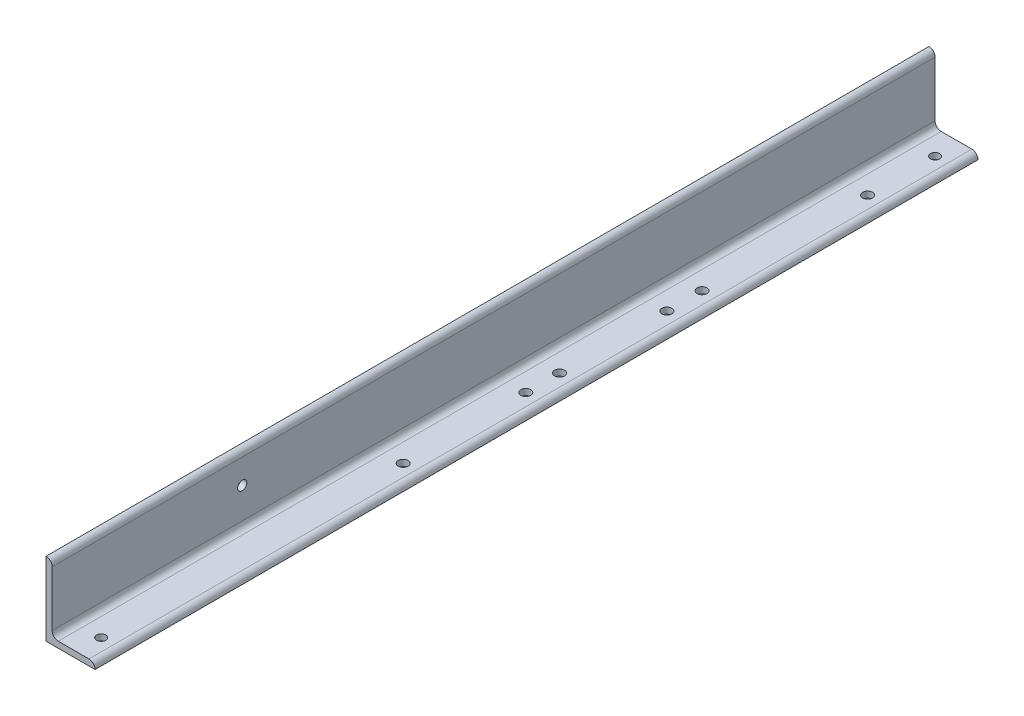
ISO-10303-21;
HEADER;
FILE_DESCRIPTION(('STEP AP214'),'2;1');
FILE_NAME('part.step','',(''),(''),'','','');
FILE_SCHEMA(('AUTOMOTIVE_DESIGN { 1 0 10303 214 1 1 1 1 }'));
ENDSEC;
DATA;
#1=APPLICATION_CONTEXT('core data for automotive mechanical design processes');
#2=APPLICATION_PROTOCOL_DEFINITION('international standard','automotive_design',2000,#1);
#3=PRODUCT_CONTEXT('',#1,'mechanical');
#4=PRODUCT('Part','Part','',(#3));
#5=PRODUCT_RELATED_PRODUCT_CATEGORY('part','',(#4));
#6=PRODUCT_DEFINITION_FORMATION('','',#4);
#7=PRODUCT_DEFINITION_CONTEXT('part definition',#1,'design');
#8=PRODUCT_DEFINITION('design','',#6,#7);
#9=PRODUCT_DEFINITION_SHAPE('','',#8);
#10=(LENGTH_UNIT() NAMED_UNIT(*) SI_UNIT(.MILLI.,.METRE.));
#11=(NAMED_UNIT(*) PLANE_ANGLE_UNIT() SI_UNIT($,.RADIAN.));
#12=(NAMED_UNIT(*) SI_UNIT($,.STERADIAN.) SOLID_ANGLE_UNIT());
#13=UNCERTAINTY_MEASURE_WITH_UNIT(LENGTH_MEASURE(1.E-05),#10,'distance_accuracy_value','');
#14=(GEOMETRIC_REPRESENTATION_CONTEXT(3) GLOBAL_UNCERTAINTY_ASSIGNED_CONTEXT((#13)) GLOBAL_UNIT_ASSIGNED_CONTEXT((#10,
#11,#12)) REPRESENTATION_CONTEXT('',''));
#15=CARTESIAN_POINT('',(0.,0.,0.));
#16=DIRECTION('',(0.,0.,1.));
#17=DIRECTION('',(1.,0.,0.));
#18=AXIS2_PLACEMENT_3D('',#15,#16,#17);
#19=CARTESIAN_POINT('',(12.7,139.70508,914.4));
#20=DIRECTION('',(-1.,0.,0.));
#21=DIRECTION('',(0.,-1.,0.));
#22=AXIS2_PLACEMENT_3D('',#19,#20,#21);
#23=PLANE('',#22);
#24=DIRECTION('',(0.,1.,0.));
#25=VECTOR('',#24,1.);
#26=CARTESIAN_POINT('',(12.7,139.70508,-914.4));
#27=LINE('',#26,#25);
#28=CARTESIAN_POINT('',(12.7,25.4,-914.4));
#29=VERTEX_POINT('',#28);
#30=CARTESIAN_POINT('',(12.7,139.70508,-914.4));
#31=VERTEX_POINT('',#30);
#32=EDGE_CURVE('E132',#29,#31,#27,.T.);
#33=ORIENTED_EDGE('',*,*,#32,.T.);
#34=DIRECTION('',(0.,0.,-1.));
#35=VECTOR('',#34,1.);
#36=CARTESIAN_POINT('',(12.7,139.70508,914.4));
#37=LINE('',#36,#35);
#38=CARTESIAN_POINT('',(12.7,139.70508,914.4));
#39=VERTEX_POINT('',#38);
#40=EDGE_CURVE('E111',#39,#31,#37,.T.);
#41=ORIENTED_EDGE('',*,*,#40,.F.);
#42=DIRECTION('',(0.,1.,0.));
#43=VECTOR('',#42,1.);
#44=CARTESIAN_POINT('',(12.7,139.70508,914.4));
#45=LINE('',#44,#43);
#46=CARTESIAN_POINT('',(12.7,25.4,914.4));
#47=VERTEX_POINT('',#46);
#48=EDGE_CURVE('E102',#47,#39,#45,.T.);
#49=ORIENTED_EDGE('',*,*,#48,.F.);
#50=DIRECTION('',(0.,0.,-1.));
#51=VECTOR('',#50,1.);
#52=CARTESIAN_POINT('',(12.7,25.4,914.4));
#53=LINE('',#52,#51);
#54=EDGE_CURVE('E141',#47,#29,#53,.T.);
#55=ORIENTED_EDGE('',*,*,#54,.T.);
#56=EDGE_LOOP('',(#33,#41,#49,#55));
#57=FACE_BOUND('',#56,.T.);
#58=CARTESIAN_POINT('',(12.7,88.9,520.7));
#59=DIRECTION('',(1.,0.,0.));
#60=DIRECTION('',(0.,0.,-1.));
#61=AXIS2_PLACEMENT_3D('',#58,#59,#60);
#62=CIRCLE('',#61,9.525);
#63=CARTESIAN_POINT('',(12.7,88.9,511.175));
#64=VERTEX_POINT('',#63);
#65=EDGE_CURVE('E228',#64,#64,#62,.T.);
#66=ORIENTED_EDGE('',*,*,#65,.F.);
#67=EDGE_LOOP('',(#66));
#68=FACE_BOUND('',#67,.T.);
#69=ADVANCED_FACE('F17',(#57,#68),#23,.F.);
#70=CARTESIAN_POINT('',(101.6,0.,914.4));
#71=DIRECTION('',(0.,1.,0.));
#72=DIRECTION('',(-1.,0.,0.));
#73=AXIS2_PLACEMENT_3D('',#70,#71,#72);
#74=PLANE('',#73);
#75=CARTESIAN_POINT('',(63.5,0.,-85.725));
#76=DIRECTION('',(0.,1.,0.));
#77=DIRECTION('',(-1.,0.,0.));
#78=AXIS2_PLACEMENT_3D('',#75,#76,#77);
#79=CIRCLE('',#78,10.31875);
#80=CARTESIAN_POINT('',(53.18125,0.,-85.725));
#81=VERTEX_POINT('',#80);
#82=EDGE_CURVE('E219',#81,#81,#79,.F.);
#83=ORIENTED_EDGE('',*,*,#82,.F.);
#84=EDGE_LOOP('',(#83));
#85=FACE_BOUND('',#84,.T.);
#86=CARTESIAN_POINT('',(63.5,0.,-307.975));
#87=DIRECTION('',(0.,1.,0.));
#88=DIRECTION('',(-1.,0.,0.));
#89=AXIS2_PLACEMENT_3D('',#86,#87,#88);
#90=CIRCLE('',#89,10.31875);
#91=CARTESIAN_POINT('',(53.18125,0.,-307.975));
#92=VERTEX_POINT('',#91);
#93=EDGE_CURVE('E213',#92,#92,#90,.F.);
#94=ORIENTED_EDGE('',*,*,#93,.F.);
#95=EDGE_LOOP('',(#94));
#96=FACE_BOUND('',#95,.T.);
#97=CARTESIAN_POINT('',(63.5,0.,238.125000000011));
#98=DIRECTION('',(0.,1.,0.));
#99=DIRECTION('',(-1.,0.,0.));
#100=AXIS2_PLACEMENT_3D('',#97,#98,#99);
#101=CIRCLE('',#100,10.31875);
#102=CARTESIAN_POINT('',(53.18125,0.,238.125000000011));
#103=VERTEX_POINT('',#102);
#104=EDGE_CURVE('E207',#103,#103,#101,.F.);
#105=ORIENTED_EDGE('',*,*,#104,.F.);
#106=EDGE_LOOP('',(#105));
#107=FACE_BOUND('',#106,.T.);
#108=CARTESIAN_POINT('',(63.5,0.,-381.));
#109=DIRECTION('',(0.,1.,0.));
#110=DIRECTION('',(-1.,0.,0.));
#111=AXIS2_PLACEMENT_3D('',#108,#109,#110);
#112=CIRCLE('',#111,10.31875);
#113=CARTESIAN_POINT('',(53.18125,0.,-381.));
#114=VERTEX_POINT('',#113);
#115=EDGE_CURVE('E201',#114,#114,#112,.F.);
#116=ORIENTED_EDGE('',*,*,#115,.F.);
#117=EDGE_LOOP('',(#116));
#118=FACE_BOUND('',#117,.T.);
#119=CARTESIAN_POINT('',(63.5,0.,-723.9));
#120=DIRECTION('',(0.,1.,0.));
#121=DIRECTION('',(-1.,0.,0.));
#122=AXIS2_PLACEMENT_3D('',#119,#120,#121);
#123=CIRCLE('',#122,10.31875);
#124=CARTESIAN_POINT('',(53.18125,0.,-723.9));
#125=VERTEX_POINT('',#124);
#126=EDGE_CURVE('E195',#125,#125,#123,.F.);
#127=ORIENTED_EDGE('',*,*,#126,.F.);
#128=EDGE_LOOP('',(#127));
#129=FACE_BOUND('',#128,.T.);
#130=CARTESIAN_POINT('',(63.5,0.,-15.8749999999889));
#131=DIRECTION('',(0.,1.,0.));
#132=DIRECTION('',(-1.,0.,0.));
#133=AXIS2_PLACEMENT_3D('',#130,#131,#132);
#134=CIRCLE('',#133,10.31875);
#135=CARTESIAN_POINT('',(53.18125,0.,-15.8749999999889));
#136=VERTEX_POINT('',#135);
#137=EDGE_CURVE('E189',#136,#136,#134,.F.);
#138=ORIENTED_EDGE('',*,*,#137,.F.);
#139=EDGE_LOOP('',(#138));
#140=FACE_BOUND('',#139,.T.);
#141=CARTESIAN_POINT('',(63.5,0.,-863.6));
#142=DIRECTION('',(0.,1.,0.));
#143=DIRECTION('',(-1.,0.,0.));
#144=AXIS2_PLACEMENT_3D('',#141,#142,#143);
#145=CIRCLE('',#144,9.525);
#146=CARTESIAN_POINT('',(53.975,0.,-863.6));
#147=VERTEX_POINT('',#146);
#148=EDGE_CURVE('E183',#147,#147,#145,.F.);
#149=ORIENTED_EDGE('',*,*,#148,.F.);
#150=EDGE_LOOP('',(#149));
#151=FACE_BOUND('',#150,.T.);
#152=CARTESIAN_POINT('',(63.5,0.,863.6));
#153=DIRECTION('',(0.,1.,0.));
#154=DIRECTION('',(-1.,0.,0.));
#155=AXIS2_PLACEMENT_3D('',#152,#153,#154);
#156=CIRCLE('',#155,9.525);
#157=CARTESIAN_POINT('',(53.975,0.,863.6));
#158=VERTEX_POINT('',#157);
#159=EDGE_CURVE('E124',#158,#158,#156,.F.);
#160=ORIENTED_EDGE('',*,*,#159,.F.);
#161=EDGE_LOOP('',(#160));
#162=FACE_BOUND('',#161,.T.);
#163=DIRECTION('',(1.,0.,0.));
#164=VECTOR('',#163,1.);
#165=CARTESIAN_POINT('',(101.6,0.,-914.4));
#166=LINE('',#165,#164);
#167=CARTESIAN_POINT('',(0.,0.,-914.4));
#168=VERTEX_POINT('',#167);
#169=CARTESIAN_POINT('',(101.6,0.,-914.4));
#170=VERTEX_POINT('',#169);
#171=EDGE_CURVE('E120',#168,#170,#166,.T.);
#172=ORIENTED_EDGE('',*,*,#171,.T.);
#173=DIRECTION('',(0.,0.,-1.));
#174=VECTOR('',#173,1.);
#175=CARTESIAN_POINT('',(101.6,0.,914.4));
#176=LINE('',#175,#174);
#177=CARTESIAN_POINT('',(101.6,0.,914.4));
#178=VERTEX_POINT('',#177);
#179=EDGE_CURVE('E11',#178,#170,#176,.T.);
#180=ORIENTED_EDGE('',*,*,#179,.F.);
#181=DIRECTION('',(1.,0.,0.));
#182=VECTOR('',#181,1.);
#183=CARTESIAN_POINT('',(101.6,0.,914.4));
#184=LINE('',#183,#182);
#185=CARTESIAN_POINT('',(0.,0.,914.4));
#186=VERTEX_POINT('',#185);
#187=EDGE_CURVE('E137',#186,#178,#184,.T.);
#188=ORIENTED_EDGE('',*,*,#187,.F.);
#189=DIRECTION('',(0.,0.,-1.));
#190=VECTOR('',#189,1.);
#191=CARTESIAN_POINT('',(0.,0.,914.4));
#192=LINE('',#191,#190);
#193=EDGE_CURVE('E116',#186,#168,#192,.T.);
#194=ORIENTED_EDGE('',*,*,#193,.T.);
#195=EDGE_LOOP('',(#172,#180,#188,#194));
#196=FACE_BOUND('',#195,.T.);
#197=ADVANCED_FACE('F19',(#85,#96,#107,#118,#129,#140,#151,#162,#196),#74,.F.);
#198=CARTESIAN_POINT('',(101.6,0.00508000000000622,914.4));
#199=DIRECTION('',(-1.,0.,0.));
#200=DIRECTION('',(0.,0.,1.));
#201=AXIS2_PLACEMENT_3D('',#198,#199,#200);
#202=PLANE('',#201);
#203=DIRECTION('',(0.,1.,0.));
#204=VECTOR('',#203,1.);
#205=CARTESIAN_POINT('',(101.6,0.00508000000000622,-914.4));
#206=LINE('',#205,#204);
#207=CARTESIAN_POINT('',(101.6,0.00508000000000622,-914.4));
#208=VERTEX_POINT('',#207);
#209=EDGE_CURVE('E123',#170,#208,#206,.T.);
#210=ORIENTED_EDGE('',*,*,#209,.T.);
#211=DIRECTION('',(0.,0.,-1.));
#212=VECTOR('',#211,1.);
#213=CARTESIAN_POINT('',(101.6,0.00508000000000622,914.4));
#214=LINE('',#213,#212);
#215=CARTESIAN_POINT('',(101.6,0.00508000000000622,914.4));
#216=VERTEX_POINT('',#215);
#217=EDGE_CURVE('E26',#216,#208,#214,.T.);
#218=ORIENTED_EDGE('',*,*,#217,.F.);
#219=DIRECTION('',(0.,1.,0.));
#220=VECTOR('',#219,1.);
#221=CARTESIAN_POINT('',(101.6,0.00508000000000622,914.4));
#222=LINE('',#221,#220);
#223=EDGE_CURVE('E80',#178,#216,#222,.T.);
#224=ORIENTED_EDGE('',*,*,#223,.F.);
#225=ORIENTED_EDGE('',*,*,#179,.T.);
#226=EDGE_LOOP('',(#210,#218,#224,#225));
#227=FACE_BOUND('',#226,.T.);
#228=ADVANCED_FACE('F242',(#227),#202,.F.);
#229=CARTESIAN_POINT('',(88.90508,0.00508000000000467,914.4));
#230=DIRECTION('',(0.,0.,-1.));
#231=DIRECTION('',(-1.,0.,0.));
#232=AXIS2_PLACEMENT_3D('',#229,#230,#231);
#233=CYLINDRICAL_SURFACE('',#232,12.69492);
#234=CARTESIAN_POINT('',(88.90508,0.00508000000000467,-914.4));
#235=DIRECTION('',(0.,0.,1.));
#236=DIRECTION('',(1.,0.,0.));
#237=AXIS2_PLACEMENT_3D('',#234,#235,#236);
#238=CIRCLE('',#237,12.69492);
#239=CARTESIAN_POINT('',(88.90508,12.7,-914.4));
#240=VERTEX_POINT('',#239);
#241=EDGE_CURVE('E126',#208,#240,#238,.T.);
#242=ORIENTED_EDGE('',*,*,#241,.T.);
#243=DIRECTION('',(0.,0.,-1.));
#244=VECTOR('',#243,1.);
#245=CARTESIAN_POINT('',(88.90508,12.7,914.4));
#246=LINE('',#245,#244);
#247=CARTESIAN_POINT('',(88.90508,12.7,914.4));
#248=VERTEX_POINT('',#247);
#249=EDGE_CURVE('E147',#248,#240,#246,.T.);
#250=ORIENTED_EDGE('',*,*,#249,.F.);
#251=CARTESIAN_POINT('',(88.90508,0.00508000000000467,914.4));
#252=DIRECTION('',(0.,0.,1.));
#253=DIRECTION('',(1.,0.,0.));
#254=AXIS2_PLACEMENT_3D('',#251,#252,#253);
#255=CIRCLE('',#254,12.69492);
#256=EDGE_CURVE('E155',#216,#248,#255,.T.);
#257=ORIENTED_EDGE('',*,*,#256,.F.);
#258=ORIENTED_EDGE('',*,*,#217,.T.);
#259=EDGE_LOOP('',(#242,#250,#257,#258));
#260=FACE_BOUND('',#259,.T.);
#261=ADVANCED_FACE('F153',(#260),#233,.T.);
#262=CARTESIAN_POINT('',(25.4,12.7,914.4));
#263=DIRECTION('',(0.,-1.,0.));
#264=DIRECTION('',(0.,0.,-1.));
#265=AXIS2_PLACEMENT_3D('',#262,#263,#264);
#266=PLANE('',#265);
#267=CARTESIAN_POINT('',(63.5,12.7,-85.725));
#268=DIRECTION('',(0.,1.,0.));
#269=DIRECTION('',(-1.,0.,0.));
#270=AXIS2_PLACEMENT_3D('',#267,#268,#269);
#271=CIRCLE('',#270,10.31875);
#272=CARTESIAN_POINT('',(53.18125,12.7,-85.725));
#273=VERTEX_POINT('',#272);
#274=EDGE_CURVE('E222',#273,#273,#271,.T.);
#275=ORIENTED_EDGE('',*,*,#274,.F.);
#276=EDGE_LOOP('',(#275));
#277=FACE_BOUND('',#276,.T.);
#278=CARTESIAN_POINT('',(63.5,12.7,-307.975));
#279=DIRECTION('',(0.,1.,0.));
#280=DIRECTION('',(-1.,0.,0.));
#281=AXIS2_PLACEMENT_3D('',#278,#279,#280);
#282=CIRCLE('',#281,10.31875);
#283=CARTESIAN_POINT('',(53.18125,12.7,-307.975));
#284=VERTEX_POINT('',#283);
#285=EDGE_CURVE('E216',#284,#284,#282,.T.);
#286=ORIENTED_EDGE('',*,*,#285,.F.);
#287=EDGE_LOOP('',(#286));
#288=FACE_BOUND('',#287,.T.);
#289=CARTESIAN_POINT('',(63.5,12.7,238.125000000011));
#290=DIRECTION('',(0.,1.,0.));
#291=DIRECTION('',(-1.,0.,0.));
#292=AXIS2_PLACEMENT_3D('',#289,#290,#291);
#293=CIRCLE('',#292,10.31875);
#294=CARTESIAN_POINT('',(53.18125,12.7,238.125000000011));
#295=VERTEX_POINT('',#294);
#296=EDGE_CURVE('E210',#295,#295,#293,.T.);
#297=ORIENTED_EDGE('',*,*,#296,.F.);
#298=EDGE_LOOP('',(#297));
#299=FACE_BOUND('',#298,.T.);
#300=CARTESIAN_POINT('',(63.5,12.7,-381.));
#301=DIRECTION('',(0.,1.,0.));
#302=DIRECTION('',(-1.,0.,0.));
#303=AXIS2_PLACEMENT_3D('',#300,#301,#302);
#304=CIRCLE('',#303,10.31875);
#305=CARTESIAN_POINT('',(53.18125,12.7,-381.));
#306=VERTEX_POINT('',#305);
#307=EDGE_CURVE('E204',#306,#306,#304,.T.);
#308=ORIENTED_EDGE('',*,*,#307,.F.);
#309=EDGE_LOOP('',(#308));
#310=FACE_BOUND('',#309,.T.);
#311=CARTESIAN_POINT('',(63.5,12.7,-723.9));
#312=DIRECTION('',(0.,1.,0.));
#313=DIRECTION('',(-1.,0.,0.));
#314=AXIS2_PLACEMENT_3D('',#311,#312,#313);
#315=CIRCLE('',#314,10.31875);
#316=CARTESIAN_POINT('',(53.18125,12.7,-723.9));
#317=VERTEX_POINT('',#316);
#318=EDGE_CURVE('E198',#317,#317,#315,.T.);
#319=ORIENTED_EDGE('',*,*,#318,.F.);
#320=EDGE_LOOP('',(#319));
#321=FACE_BOUND('',#320,.T.);
#322=CARTESIAN_POINT('',(63.5,12.7,-15.8749999999889));
#323=DIRECTION('',(0.,1.,0.));
#324=DIRECTION('',(-1.,0.,0.));
#325=AXIS2_PLACEMENT_3D('',#322,#323,#324);
#326=CIRCLE('',#325,10.31875);
#327=CARTESIAN_POINT('',(53.18125,12.7,-15.8749999999889));
#328=VERTEX_POINT('',#327);
#329=EDGE_CURVE('E192',#328,#328,#326,.T.);
#330=ORIENTED_EDGE('',*,*,#329,.F.);
#331=EDGE_LOOP('',(#330));
#332=FACE_BOUND('',#331,.T.);
#333=CARTESIAN_POINT('',(63.5,12.7,-863.6));
#334=DIRECTION('',(0.,1.,0.));
#335=DIRECTION('',(-1.,0.,0.));
#336=AXIS2_PLACEMENT_3D('',#333,#334,#335);
#337=CIRCLE('',#336,9.525);
#338=CARTESIAN_POINT('',(53.975,12.7,-863.6));
#339=VERTEX_POINT('',#338);
#340=EDGE_CURVE('E186',#339,#339,#337,.T.);
#341=ORIENTED_EDGE('',*,*,#340,.F.);
#342=EDGE_LOOP('',(#341));
#343=FACE_BOUND('',#342,.T.);
#344=CARTESIAN_POINT('',(63.5,12.7,863.6));
#345=DIRECTION('',(0.,1.,0.));
#346=DIRECTION('',(-1.,0.,0.));
#347=AXIS2_PLACEMENT_3D('',#344,#345,#346);
#348=CIRCLE('',#347,9.525);
#349=CARTESIAN_POINT('',(53.975,12.7,863.6));
#350=VERTEX_POINT('',#349);
#351=EDGE_CURVE('E180',#350,#350,#348,.T.);
#352=ORIENTED_EDGE('',*,*,#351,.F.);
#353=EDGE_LOOP('',(#352));
#354=FACE_BOUND('',#353,.T.);
#355=DIRECTION('',(-1.,0.,0.));
#356=VECTOR('',#355,1.);
#357=CARTESIAN_POINT('',(25.4,12.7,-914.4));
#358=LINE('',#357,#356);
#359=CARTESIAN_POINT('',(25.4,12.7,-914.4));
#360=VERTEX_POINT('',#359);
#361=EDGE_CURVE('E128',#240,#360,#358,.T.);
#362=ORIENTED_EDGE('',*,*,#361,.T.);
#363=DIRECTION('',(0.,0.,-1.));
#364=VECTOR('',#363,1.);
#365=CARTESIAN_POINT('',(25.4,12.7,914.4));
#366=LINE('',#365,#364);
#367=CARTESIAN_POINT('',(25.4,12.7,914.4));
#368=VERTEX_POINT('',#367);
#369=EDGE_CURVE('E144',#368,#360,#366,.T.);
#370=ORIENTED_EDGE('',*,*,#369,.F.);
#371=DIRECTION('',(-1.,0.,0.));
#372=VECTOR('',#371,1.);
#373=CARTESIAN_POINT('',(25.4,12.7,914.4));
#374=LINE('',#373,#372);
#375=EDGE_CURVE('E171',#248,#368,#374,.T.);
#376=ORIENTED_EDGE('',*,*,#375,.F.);
#377=ORIENTED_EDGE('',*,*,#249,.T.);
#378=EDGE_LOOP('',(#362,#370,#376,#377));
#379=FACE_BOUND('',#378,.T.);
#380=ADVANCED_FACE('F164',(#277,#288,#299,#310,#321,#332,#343,#354,#379),#266,.F.);
#381=CARTESIAN_POINT('',(25.4,25.4,914.4));
#382=DIRECTION('',(0.,0.,-1.));
#383=DIRECTION('',(-1.,0.,0.));
#384=AXIS2_PLACEMENT_3D('',#381,#382,#383);
#385=CYLINDRICAL_SURFACE('',#384,12.7);
#386=CARTESIAN_POINT('',(25.4,25.4,-914.4));
#387=DIRECTION('',(0.,0.,-1.));
#388=DIRECTION('',(-1.,0.,0.));
#389=AXIS2_PLACEMENT_3D('',#386,#387,#388);
#390=CIRCLE('',#389,12.7);
#391=EDGE_CURVE('E130',#360,#29,#390,.T.);
#392=ORIENTED_EDGE('',*,*,#391,.T.);
#393=ORIENTED_EDGE('',*,*,#54,.F.);
#394=CARTESIAN_POINT('',(25.4,25.4,914.4));
#395=DIRECTION('',(0.,0.,-1.));
#396=DIRECTION('',(-1.,0.,0.));
#397=AXIS2_PLACEMENT_3D('',#394,#395,#396);
#398=CIRCLE('',#397,12.7);
#399=EDGE_CURVE('E170',#368,#47,#398,.T.);
#400=ORIENTED_EDGE('',*,*,#399,.F.);
#401=ORIENTED_EDGE('',*,*,#369,.T.);
#402=EDGE_LOOP('',(#392,#393,#400,#401));
#403=FACE_BOUND('',#402,.T.);
#404=ADVANCED_FACE('F168',(#403),#385,.F.);
#405=CARTESIAN_POINT('',(0.00508000000000078,139.70508,914.4));
#406=DIRECTION('',(0.,0.,-1.));
#407=DIRECTION('',(-1.,0.,0.));
#408=AXIS2_PLACEMENT_3D('',#405,#406,#407);
#409=CYLINDRICAL_SURFACE('',#408,12.69492);
#410=CARTESIAN_POINT('',(0.00508000000000078,139.70508,-914.4));
#411=DIRECTION('',(0.,0.,1.));
#412=DIRECTION('',(-1.,0.,0.));
#413=AXIS2_PLACEMENT_3D('',#410,#411,#412);
#414=CIRCLE('',#413,12.69492);
#415=CARTESIAN_POINT('',(0.00508,152.4,-914.4));
#416=VERTEX_POINT('',#415);
#417=EDGE_CURVE('E110',#31,#416,#414,.T.);
#418=ORIENTED_EDGE('',*,*,#417,.T.);
#419=DIRECTION('',(0.,0.,-1.));
#420=VECTOR('',#419,1.);
#421=CARTESIAN_POINT('',(0.00508,152.4,914.4));
#422=LINE('',#421,#420);
#423=CARTESIAN_POINT('',(0.00508,152.4,914.4));
#424=VERTEX_POINT('',#423);
#425=EDGE_CURVE('E107',#424,#416,#422,.T.);
#426=ORIENTED_EDGE('',*,*,#425,.F.);
#427=CARTESIAN_POINT('',(0.00508000000000078,139.70508,914.4));
#428=DIRECTION('',(0.,0.,1.));
#429=DIRECTION('',(-1.,0.,0.));
#430=AXIS2_PLACEMENT_3D('',#427,#428,#429);
#431=CIRCLE('',#430,12.69492);
#432=EDGE_CURVE('E96',#39,#424,#431,.T.);
#433=ORIENTED_EDGE('',*,*,#432,.F.);
#434=ORIENTED_EDGE('',*,*,#40,.T.);
#435=EDGE_LOOP('',(#418,#426,#433,#434));
#436=FACE_BOUND('',#435,.T.);
#437=ADVANCED_FACE('F108',(#436),#409,.T.);
#438=CARTESIAN_POINT('',(0.,152.4,914.4));
#439=DIRECTION('',(0.,-1.,0.));
#440=DIRECTION('',(0.,0.,-1.));
#441=AXIS2_PLACEMENT_3D('',#438,#439,#440);
#442=PLANE('',#441);
#443=DIRECTION('',(-1.,0.,0.));
#444=VECTOR('',#443,1.);
#445=CARTESIAN_POINT('',(0.,152.4,-914.4));
#446=LINE('',#445,#444);
#447=CARTESIAN_POINT('',(0.,152.4,-914.4));
#448=VERTEX_POINT('',#447);
#449=EDGE_CURVE('E66',#416,#448,#446,.T.);
#450=ORIENTED_EDGE('',*,*,#449,.T.);
#451=DIRECTION('',(0.,0.,-1.));
#452=VECTOR('',#451,1.);
#453=CARTESIAN_POINT('',(0.,152.4,914.4));
#454=LINE('',#453,#452);
#455=CARTESIAN_POINT('',(0.,152.4,914.4));
#456=VERTEX_POINT('',#455);
#457=EDGE_CURVE('E112',#456,#448,#454,.T.);
#458=ORIENTED_EDGE('',*,*,#457,.F.);
#459=DIRECTION('',(-1.,0.,0.));
#460=VECTOR('',#459,1.);
#461=CARTESIAN_POINT('',(0.,152.4,914.4));
#462=LINE('',#461,#460);
#463=EDGE_CURVE('E100',#424,#456,#462,.T.);
#464=ORIENTED_EDGE('',*,*,#463,.F.);
#465=ORIENTED_EDGE('',*,*,#425,.T.);
#466=EDGE_LOOP('',(#450,#458,#464,#465));
#467=FACE_BOUND('',#466,.T.);
#468=ADVANCED_FACE('F114',(#467),#442,.F.);
#469=CARTESIAN_POINT('',(0.,0.,914.4));
#470=DIRECTION('',(1.,0.,0.));
#471=DIRECTION('',(0.,0.,-1.));
#472=AXIS2_PLACEMENT_3D('',#469,#470,#471);
#473=PLANE('',#472);
#474=CARTESIAN_POINT('',(0.,88.9,520.7));
#475=DIRECTION('',(1.,0.,0.));
#476=DIRECTION('',(0.,0.,-1.));
#477=AXIS2_PLACEMENT_3D('',#474,#475,#476);
#478=CIRCLE('',#477,9.525);
#479=CARTESIAN_POINT('',(0.,88.9,511.175));
#480=VERTEX_POINT('',#479);
#481=EDGE_CURVE('E225',#480,#480,#478,.T.);
#482=ORIENTED_EDGE('',*,*,#481,.T.);
#483=EDGE_LOOP('',(#482));
#484=FACE_BOUND('',#483,.T.);
#485=DIRECTION('',(0.,-1.,0.));
#486=VECTOR('',#485,1.);
#487=CARTESIAN_POINT('',(0.,0.,-914.4));
#488=LINE('',#487,#486);
#489=EDGE_CURVE('E72',#448,#168,#488,.T.);
#490=ORIENTED_EDGE('',*,*,#489,.T.);
#491=ORIENTED_EDGE('',*,*,#193,.F.);
#492=DIRECTION('',(0.,-1.,0.));
#493=VECTOR('',#492,1.);
#494=CARTESIAN_POINT('',(0.,0.,914.4));
#495=LINE('',#494,#493);
#496=EDGE_CURVE('E34',#456,#186,#495,.T.);
#497=ORIENTED_EDGE('',*,*,#496,.F.);
#498=ORIENTED_EDGE('',*,*,#457,.T.);
#499=EDGE_LOOP('',(#490,#491,#497,#498));
#500=FACE_BOUND('',#499,.T.);
#501=ADVANCED_FACE('F260',(#484,#500),#473,.F.);
#502=CARTESIAN_POINT('',(0.00508000000000078,139.70508,914.4));
#503=DIRECTION('',(0.,0.,-1.));
#504=DIRECTION('',(-1.,0.,0.));
#505=AXIS2_PLACEMENT_3D('',#502,#503,#504);
#506=PLANE('',#505);
#507=ORIENTED_EDGE('',*,*,#187,.T.);
#508=ORIENTED_EDGE('',*,*,#223,.T.);
#509=ORIENTED_EDGE('',*,*,#256,.T.);
#510=ORIENTED_EDGE('',*,*,#375,.T.);
#511=ORIENTED_EDGE('',*,*,#399,.T.);
#512=ORIENTED_EDGE('',*,*,#48,.T.);
#513=ORIENTED_EDGE('',*,*,#432,.T.);
#514=ORIENTED_EDGE('',*,*,#463,.T.);
#515=ORIENTED_EDGE('',*,*,#496,.T.);
#516=EDGE_LOOP('',(#507,#508,#509,#510,#511,#512,#513,#514,#515));
#517=FACE_BOUND('',#516,.T.);
#518=ADVANCED_FACE('F98',(#517),#506,.F.);
#519=CARTESIAN_POINT('',(0.00508000000000078,139.70508,-914.4));
#520=DIRECTION('',(0.,0.,-1.));
#521=DIRECTION('',(-1.,0.,0.));
#522=AXIS2_PLACEMENT_3D('',#519,#520,#521);
#523=PLANE('',#522);
#524=ORIENTED_EDGE('',*,*,#171,.F.);
#525=ORIENTED_EDGE('',*,*,#489,.F.);
#526=ORIENTED_EDGE('',*,*,#449,.F.);
#527=ORIENTED_EDGE('',*,*,#417,.F.);
#528=ORIENTED_EDGE('',*,*,#32,.F.);
#529=ORIENTED_EDGE('',*,*,#391,.F.);
#530=ORIENTED_EDGE('',*,*,#361,.F.);
#531=ORIENTED_EDGE('',*,*,#241,.F.);
#532=ORIENTED_EDGE('',*,*,#209,.F.);
#533=EDGE_LOOP('',(#524,#525,#526,#527,#528,#529,#530,#531,#532));
#534=FACE_BOUND('',#533,.T.);
#535=ADVANCED_FACE('F159',(#534),#523,.T.);
#536=CARTESIAN_POINT('',(63.5,-0.001000000000001,863.6));
#537=DIRECTION('',(0.,1.,0.));
#538=DIRECTION('',(-1.,0.,0.));
#539=AXIS2_PLACEMENT_3D('',#536,#537,#538);
#540=CYLINDRICAL_SURFACE('',#539,9.525);
#541=ORIENTED_EDGE('',*,*,#351,.T.);
#542=EDGE_LOOP('',(#541));
#543=FACE_BOUND('',#542,.T.);
#544=ORIENTED_EDGE('',*,*,#159,.T.);
#545=EDGE_LOOP('',(#544));
#546=FACE_BOUND('',#545,.T.);
#547=ADVANCED_FACE('F272',(#543,#546),#540,.F.);
#548=CARTESIAN_POINT('',(63.5,-0.001000000000001,-863.6));
#549=DIRECTION('',(0.,1.,0.));
#550=DIRECTION('',(-1.,0.,0.));
#551=AXIS2_PLACEMENT_3D('',#548,#549,#550);
#552=CYLINDRICAL_SURFACE('',#551,9.525);
#553=ORIENTED_EDGE('',*,*,#340,.T.);
#554=EDGE_LOOP('',(#553));
#555=FACE_BOUND('',#554,.T.);
#556=ORIENTED_EDGE('',*,*,#148,.T.);
#557=EDGE_LOOP('',(#556));
#558=FACE_BOUND('',#557,.T.);
#559=ADVANCED_FACE('F276',(#555,#558),#552,.F.);
#560=CARTESIAN_POINT('',(63.5,-0.001000000000001,-15.8749999999889));
#561=DIRECTION('',(0.,1.,0.));
#562=DIRECTION('',(-1.,0.,0.));
#563=AXIS2_PLACEMENT_3D('',#560,#561,#562);
#564=CYLINDRICAL_SURFACE('',#563,10.31875);
#565=ORIENTED_EDGE('',*,*,#329,.T.);
#566=EDGE_LOOP('',(#565));
#567=FACE_BOUND('',#566,.T.);
#568=ORIENTED_EDGE('',*,*,#137,.T.);
#569=EDGE_LOOP('',(#568));
#570=FACE_BOUND('',#569,.T.);
#571=ADVANCED_FACE('F280',(#567,#570),#564,.F.);
#572=CARTESIAN_POINT('',(63.5,-0.001000000000001,-723.9));
#573=DIRECTION('',(0.,1.,0.));
#574=DIRECTION('',(-1.,0.,0.));
#575=AXIS2_PLACEMENT_3D('',#572,#573,#574);
#576=CYLINDRICAL_SURFACE('',#575,10.31875);
#577=ORIENTED_EDGE('',*,*,#318,.T.);
#578=EDGE_LOOP('',(#577));
#579=FACE_BOUND('',#578,.T.);
#580=ORIENTED_EDGE('',*,*,#126,.T.);
#581=EDGE_LOOP('',(#580));
#582=FACE_BOUND('',#581,.T.);
#583=ADVANCED_FACE('F284',(#579,#582),#576,.F.);
#584=CARTESIAN_POINT('',(63.5,-0.001000000000001,-381.));
#585=DIRECTION('',(0.,1.,0.));
#586=DIRECTION('',(-1.,0.,0.));
#587=AXIS2_PLACEMENT_3D('',#584,#585,#586);
#588=CYLINDRICAL_SURFACE('',#587,10.31875);
#589=ORIENTED_EDGE('',*,*,#307,.T.);
#590=EDGE_LOOP('',(#589));
#591=FACE_BOUND('',#590,.T.);
#592=ORIENTED_EDGE('',*,*,#115,.T.);
#593=EDGE_LOOP('',(#592));
#594=FACE_BOUND('',#593,.T.);
#595=ADVANCED_FACE('F288',(#591,#594),#588,.F.);
#596=CARTESIAN_POINT('',(63.5,-0.001000000000001,238.125000000011));
#597=DIRECTION('',(0.,1.,0.));
#598=DIRECTION('',(-1.,0.,0.));
#599=AXIS2_PLACEMENT_3D('',#596,#597,#598);
#600=CYLINDRICAL_SURFACE('',#599,10.31875);
#601=ORIENTED_EDGE('',*,*,#296,.T.);
#602=EDGE_LOOP('',(#601));
#603=FACE_BOUND('',#602,.T.);
#604=ORIENTED_EDGE('',*,*,#104,.T.);
#605=EDGE_LOOP('',(#604));
#606=FACE_BOUND('',#605,.T.);
#607=ADVANCED_FACE('F292',(#603,#606),#600,.F.);
#608=CARTESIAN_POINT('',(63.5,-0.001000000000001,-307.975));
#609=DIRECTION('',(0.,1.,0.));
#610=DIRECTION('',(-1.,0.,0.));
#611=AXIS2_PLACEMENT_3D('',#608,#609,#610);
#612=CYLINDRICAL_SURFACE('',#611,10.31875);
#613=ORIENTED_EDGE('',*,*,#285,.T.);
#614=EDGE_LOOP('',(#613));
#615=FACE_BOUND('',#614,.T.);
#616=ORIENTED_EDGE('',*,*,#93,.T.);
#617=EDGE_LOOP('',(#616));
#618=FACE_BOUND('',#617,.T.);
#619=ADVANCED_FACE('F296',(#615,#618),#612,.F.);
#620=CARTESIAN_POINT('',(63.5,-0.001000000000001,-85.725));
#621=DIRECTION('',(0.,1.,0.));
#622=DIRECTION('',(-1.,0.,0.));
#623=AXIS2_PLACEMENT_3D('',#620,#621,#622);
#624=CYLINDRICAL_SURFACE('',#623,10.31875);
#625=ORIENTED_EDGE('',*,*,#274,.T.);
#626=EDGE_LOOP('',(#625));
#627=FACE_BOUND('',#626,.T.);
#628=ORIENTED_EDGE('',*,*,#82,.T.);
#629=EDGE_LOOP('',(#628));
#630=FACE_BOUND('',#629,.T.);
#631=ADVANCED_FACE('F300',(#627,#630),#624,.F.);
#632=CARTESIAN_POINT('',(12.7,88.9,520.7));
#633=DIRECTION('',(1.,0.,0.));
#634=DIRECTION('',(0.,0.,-1.));
#635=AXIS2_PLACEMENT_3D('',#632,#633,#634);
#636=CYLINDRICAL_SURFACE('',#635,9.525);
#637=ORIENTED_EDGE('',*,*,#481,.F.);
#638=EDGE_LOOP('',(#637));
#639=FACE_BOUND('',#638,.T.);
#640=ORIENTED_EDGE('',*,*,#65,.T.);
#641=EDGE_LOOP('',(#640));
#642=FACE_BOUND('',#641,.T.);
#643=ADVANCED_FACE('F232',(#639,#642),#636,.F.);
#644=CLOSED_SHELL('',(#69,#197,#228,#261,#380,#404,#437,#468,#501,#518,#535,#547,#559,#571,#583,
#595,#607,#619,#631,#643));
#645=MANIFOLD_SOLID_BREP('B1',#644);
#646=ADVANCED_BREP_SHAPE_REPRESENTATION('',(#18,#645),#14);
#647=SHAPE_DEFINITION_REPRESENTATION(#9,#646);
ENDSEC;
END-ISO-10303-21;
